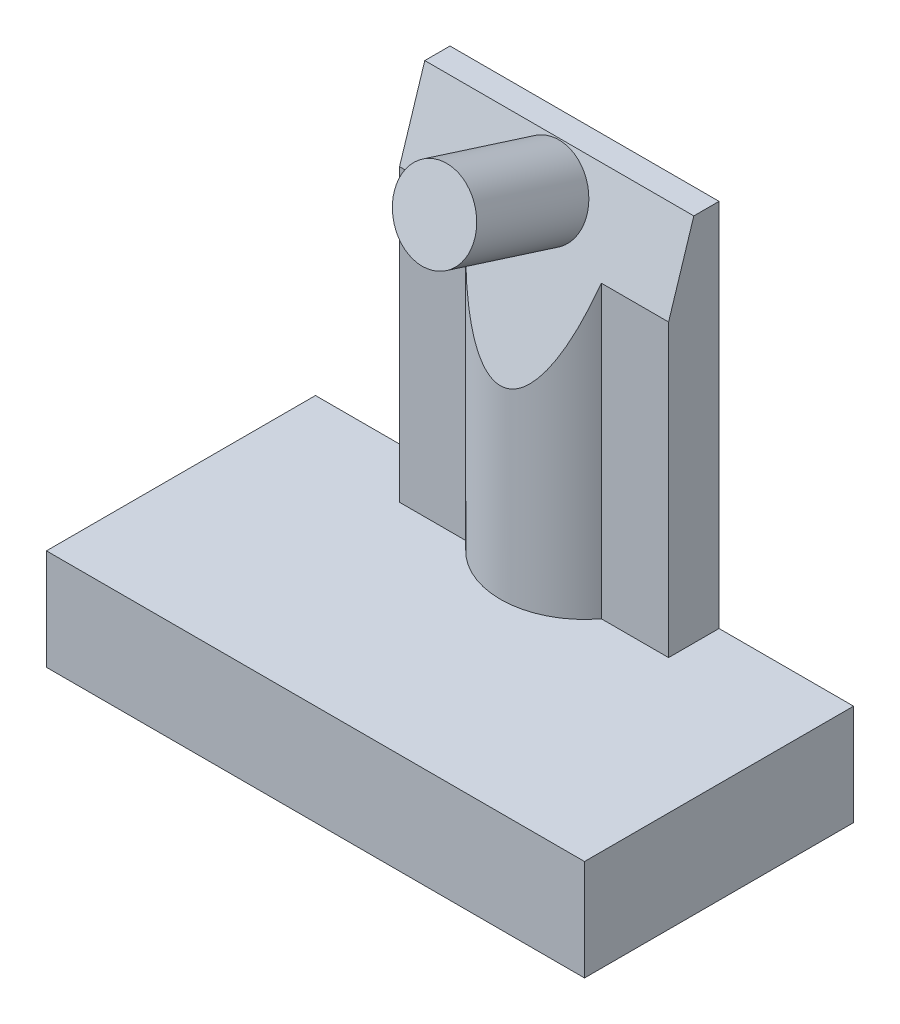
ISO-10303-21;
HEADER;
FILE_DESCRIPTION(('STEP AP214'),'2;1');
FILE_NAME('part.step','',(''),(''),'','','');
FILE_SCHEMA(('AUTOMOTIVE_DESIGN { 1 0 10303 214 1 1 1 1 }'));
ENDSEC;
DATA;
#1=APPLICATION_CONTEXT('core data for automotive mechanical design processes');
#2=APPLICATION_PROTOCOL_DEFINITION('international standard','automotive_design',2000,#1);
#3=PRODUCT_CONTEXT('',#1,'mechanical');
#4=PRODUCT('Part','Part','',(#3));
#5=PRODUCT_RELATED_PRODUCT_CATEGORY('part','',(#4));
#6=PRODUCT_DEFINITION_FORMATION('','',#4);
#7=PRODUCT_DEFINITION_CONTEXT('part definition',#1,'design');
#8=PRODUCT_DEFINITION('design','',#6,#7);
#9=PRODUCT_DEFINITION_SHAPE('','',#8);
#10=(LENGTH_UNIT() NAMED_UNIT(*) SI_UNIT(.MILLI.,.METRE.));
#11=(NAMED_UNIT(*) PLANE_ANGLE_UNIT() SI_UNIT($,.RADIAN.));
#12=(NAMED_UNIT(*) SI_UNIT($,.STERADIAN.) SOLID_ANGLE_UNIT());
#13=UNCERTAINTY_MEASURE_WITH_UNIT(LENGTH_MEASURE(1.E-05),#10,'distance_accuracy_value','');
#14=(GEOMETRIC_REPRESENTATION_CONTEXT(3) GLOBAL_UNCERTAINTY_ASSIGNED_CONTEXT((#13)) GLOBAL_UNIT_ASSIGNED_CONTEXT((#10,
#11,#12)) REPRESENTATION_CONTEXT('',''));
#15=CARTESIAN_POINT('',(0.,0.,0.));
#16=DIRECTION('',(0.,0.,1.));
#17=DIRECTION('',(1.,0.,0.));
#18=AXIS2_PLACEMENT_3D('',#15,#16,#17);
#19=CARTESIAN_POINT('',(8.,3.,-4.));
#20=DIRECTION('',(-1.,0.,0.));
#21=DIRECTION('',(0.,0.,1.));
#22=AXIS2_PLACEMENT_3D('',#19,#20,#21);
#23=PLANE('',#22);
#24=DIRECTION('',(0.,0.,-1.));
#25=VECTOR('',#24,1.);
#26=CARTESIAN_POINT('',(8.,0.,-4.));
#27=LINE('',#26,#25);
#28=CARTESIAN_POINT('',(8.,0.,4.));
#29=VERTEX_POINT('',#28);
#30=CARTESIAN_POINT('',(8.,0.,-4.));
#31=VERTEX_POINT('',#30);
#32=EDGE_CURVE('E208',#29,#31,#27,.T.);
#33=ORIENTED_EDGE('',*,*,#32,.T.);
#34=DIRECTION('',(0.,-1.,0.));
#35=VECTOR('',#34,1.);
#36=CARTESIAN_POINT('',(8.,3.,-4.));
#37=LINE('',#36,#35);
#38=CARTESIAN_POINT('',(8.,3.,-4.));
#39=VERTEX_POINT('',#38);
#40=EDGE_CURVE('E285',#39,#31,#37,.T.);
#41=ORIENTED_EDGE('',*,*,#40,.F.);
#42=DIRECTION('',(0.,0.,-1.));
#43=VECTOR('',#42,1.);
#44=CARTESIAN_POINT('',(8.,3.,-4.));
#45=LINE('',#44,#43);
#46=CARTESIAN_POINT('',(8.,3.,4.));
#47=VERTEX_POINT('',#46);
#48=EDGE_CURVE('E247',#47,#39,#45,.T.);
#49=ORIENTED_EDGE('',*,*,#48,.F.);
#50=DIRECTION('',(0.,-1.,0.));
#51=VECTOR('',#50,1.);
#52=CARTESIAN_POINT('',(8.,3.,4.));
#53=LINE('',#52,#51);
#54=EDGE_CURVE('E262',#47,#29,#53,.T.);
#55=ORIENTED_EDGE('',*,*,#54,.T.);
#56=EDGE_LOOP('',(#33,#41,#49,#55));
#57=FACE_BOUND('',#56,.T.);
#58=ADVANCED_FACE('F45',(#57),#23,.F.);
#59=CARTESIAN_POINT('',(-8.,3.,-4.));
#60=DIRECTION('',(0.,0.,1.));
#61=DIRECTION('',(1.,0.,0.));
#62=AXIS2_PLACEMENT_3D('',#59,#60,#61);
#63=PLANE('',#62);
#64=DIRECTION('',(-1.,0.,0.));
#65=VECTOR('',#64,1.);
#66=CARTESIAN_POINT('',(-8.,0.,-4.));
#67=LINE('',#66,#65);
#68=CARTESIAN_POINT('',(-8.,0.,-4.));
#69=VERTEX_POINT('',#68);
#70=EDGE_CURVE('E266',#31,#69,#67,.T.);
#71=ORIENTED_EDGE('',*,*,#70,.T.);
#72=DIRECTION('',(0.,-1.,0.));
#73=VECTOR('',#72,1.);
#74=CARTESIAN_POINT('',(-8.,3.,-4.));
#75=LINE('',#74,#73);
#76=CARTESIAN_POINT('',(-8.,3.,-4.));
#77=VERTEX_POINT('',#76);
#78=EDGE_CURVE('E281',#77,#69,#75,.T.);
#79=ORIENTED_EDGE('',*,*,#78,.F.);
#80=DIRECTION('',(-1.,0.,0.));
#81=VECTOR('',#80,1.);
#82=CARTESIAN_POINT('',(-8.,3.,-4.));
#83=LINE('',#82,#81);
#84=CARTESIAN_POINT('',(-4.,3.,-4.));
#85=VERTEX_POINT('',#84);
#86=EDGE_CURVE('E251',#85,#77,#83,.T.);
#87=ORIENTED_EDGE('',*,*,#86,.F.);
#88=DIRECTION('',(0.,-1.,0.));
#89=VECTOR('',#88,1.);
#90=CARTESIAN_POINT('',(-4.,14.,-4.));
#91=LINE('',#90,#89);
#92=CARTESIAN_POINT('',(-4.,14.,-4.));
#93=VERTEX_POINT('',#92);
#94=EDGE_CURVE('E188',#93,#85,#91,.T.);
#95=ORIENTED_EDGE('',*,*,#94,.F.);
#96=DIRECTION('',(-1.,0.,0.));
#97=VECTOR('',#96,1.);
#98=CARTESIAN_POINT('',(-4.,14.,-4.));
#99=LINE('',#98,#97);
#100=CARTESIAN_POINT('',(4.,14.,-4.));
#101=VERTEX_POINT('',#100);
#102=EDGE_CURVE('E308',#101,#93,#99,.T.);
#103=ORIENTED_EDGE('',*,*,#102,.F.);
#104=DIRECTION('',(0.,-1.,0.));
#105=VECTOR('',#104,1.);
#106=CARTESIAN_POINT('',(4.,14.,-4.));
#107=LINE('',#106,#105);
#108=CARTESIAN_POINT('',(4.,3.,-4.));
#109=VERTEX_POINT('',#108);
#110=EDGE_CURVE('E181',#101,#109,#107,.T.);
#111=ORIENTED_EDGE('',*,*,#110,.T.);
#112=EDGE_CURVE('E253',#39,#109,#83,.T.);
#113=ORIENTED_EDGE('',*,*,#112,.F.);
#114=ORIENTED_EDGE('',*,*,#40,.T.);
#115=EDGE_LOOP('',(#71,#79,#87,#95,#103,#111,#113,#114));
#116=FACE_BOUND('',#115,.T.);
#117=ADVANCED_FACE('F337',(#116),#63,.F.);
#118=CARTESIAN_POINT('',(-8.,3.,-4.));
#119=DIRECTION('',(1.,0.,0.));
#120=DIRECTION('',(0.,0.,-1.));
#121=AXIS2_PLACEMENT_3D('',#118,#119,#120);
#122=PLANE('',#121);
#123=DIRECTION('',(0.,0.,1.));
#124=VECTOR('',#123,1.);
#125=CARTESIAN_POINT('',(-8.,0.,-4.));
#126=LINE('',#125,#124);
#127=CARTESIAN_POINT('',(-8.,0.,4.));
#128=VERTEX_POINT('',#127);
#129=EDGE_CURVE('E269',#69,#128,#126,.T.);
#130=ORIENTED_EDGE('',*,*,#129,.T.);
#131=DIRECTION('',(0.,-1.,0.));
#132=VECTOR('',#131,1.);
#133=CARTESIAN_POINT('',(-8.,3.,4.));
#134=LINE('',#133,#132);
#135=CARTESIAN_POINT('',(-8.,3.,4.));
#136=VERTEX_POINT('',#135);
#137=EDGE_CURVE('E277',#136,#128,#134,.T.);
#138=ORIENTED_EDGE('',*,*,#137,.F.);
#139=DIRECTION('',(0.,0.,1.));
#140=VECTOR('',#139,1.);
#141=CARTESIAN_POINT('',(-8.,3.,-4.));
#142=LINE('',#141,#140);
#143=EDGE_CURVE('E256',#77,#136,#142,.T.);
#144=ORIENTED_EDGE('',*,*,#143,.F.);
#145=ORIENTED_EDGE('',*,*,#78,.T.);
#146=EDGE_LOOP('',(#130,#138,#144,#145));
#147=FACE_BOUND('',#146,.T.);
#148=ADVANCED_FACE('F365',(#147),#122,.F.);
#149=CARTESIAN_POINT('',(-8.,3.,4.));
#150=DIRECTION('',(0.,0.,-1.));
#151=DIRECTION('',(-1.,0.,0.));
#152=AXIS2_PLACEMENT_3D('',#149,#150,#151);
#153=PLANE('',#152);
#154=DIRECTION('',(1.,0.,0.));
#155=VECTOR('',#154,1.);
#156=CARTESIAN_POINT('',(-8.,0.,4.));
#157=LINE('',#156,#155);
#158=EDGE_CURVE('E252',#128,#29,#157,.T.);
#159=ORIENTED_EDGE('',*,*,#158,.T.);
#160=ORIENTED_EDGE('',*,*,#54,.F.);
#161=DIRECTION('',(1.,0.,0.));
#162=VECTOR('',#161,1.);
#163=CARTESIAN_POINT('',(-8.,3.,4.));
#164=LINE('',#163,#162);
#165=EDGE_CURVE('E259',#136,#47,#164,.T.);
#166=ORIENTED_EDGE('',*,*,#165,.F.);
#167=ORIENTED_EDGE('',*,*,#137,.T.);
#168=EDGE_LOOP('',(#159,#160,#166,#167));
#169=FACE_BOUND('',#168,.T.);
#170=ADVANCED_FACE('F367',(#169),#153,.F.);
#171=CARTESIAN_POINT('',(0.,3.,0.));
#172=DIRECTION('',(0.,1.,0.));
#173=DIRECTION('',(0.,0.,1.));
#174=AXIS2_PLACEMENT_3D('',#171,#172,#173);
#175=PLANE('',#174);
#176=DIRECTION('',(0.,0.,1.));
#177=VECTOR('',#176,1.);
#178=CARTESIAN_POINT('',(-4.,3.,-4.));
#179=LINE('',#178,#177);
#180=CARTESIAN_POINT('',(-4.,3.,-2.5));
#181=VERTEX_POINT('',#180);
#182=EDGE_CURVE('E327',#85,#181,#179,.T.);
#183=ORIENTED_EDGE('',*,*,#182,.F.);
#184=ORIENTED_EDGE('',*,*,#86,.T.);
#185=ORIENTED_EDGE('',*,*,#143,.T.);
#186=ORIENTED_EDGE('',*,*,#165,.T.);
#187=ORIENTED_EDGE('',*,*,#48,.T.);
#188=ORIENTED_EDGE('',*,*,#112,.T.);
#189=DIRECTION('',(0.,0.,-1.));
#190=VECTOR('',#189,1.);
#191=CARTESIAN_POINT('',(4.,3.,-4.));
#192=LINE('',#191,#190);
#193=CARTESIAN_POINT('',(4.,3.,-2.5));
#194=VERTEX_POINT('',#193);
#195=EDGE_CURVE('E324',#194,#109,#192,.T.);
#196=ORIENTED_EDGE('',*,*,#195,.F.);
#197=DIRECTION('',(1.,0.,0.));
#198=VECTOR('',#197,1.);
#199=CARTESIAN_POINT('',(4.,3.,-2.5));
#200=LINE('',#199,#198);
#201=CARTESIAN_POINT('',(2.,3.,-2.5));
#202=VERTEX_POINT('',#201);
#203=EDGE_CURVE('E178',#202,#194,#200,.T.);
#204=ORIENTED_EDGE('',*,*,#203,.F.);
#205=CARTESIAN_POINT('',(0.,3.,-4.));
#206=DIRECTION('',(0.,1.,0.));
#207=DIRECTION('',(0.,0.,1.));
#208=AXIS2_PLACEMENT_3D('',#205,#206,#207);
#209=CIRCLE('',#208,2.5);
#210=CARTESIAN_POINT('',(-2.,3.,-2.5));
#211=VERTEX_POINT('',#210);
#212=EDGE_CURVE('E161',#211,#202,#209,.T.);
#213=ORIENTED_EDGE('',*,*,#212,.F.);
#214=DIRECTION('',(1.,0.,0.));
#215=VECTOR('',#214,1.);
#216=CARTESIAN_POINT('',(-4.,3.,-2.5));
#217=LINE('',#216,#215);
#218=EDGE_CURVE('E330',#181,#211,#217,.T.);
#219=ORIENTED_EDGE('',*,*,#218,.F.);
#220=EDGE_LOOP('',(#183,#184,#185,#186,#187,#188,#196,#204,#213,#219));
#221=FACE_BOUND('',#220,.T.);
#222=ADVANCED_FACE('F342',(#221),#175,.T.);
#223=CARTESIAN_POINT('',(0.,0.,0.));
#224=DIRECTION('',(0.,1.,0.));
#225=DIRECTION('',(0.,0.,1.));
#226=AXIS2_PLACEMENT_3D('',#223,#224,#225);
#227=PLANE('',#226);
#228=DIRECTION('',(1.,0.,0.));
#229=VECTOR('',#228,1.);
#230=CARTESIAN_POINT('',(-8.,0.,3.));
#231=LINE('',#230,#229);
#232=CARTESIAN_POINT('',(-7.,0.,3.));
#233=VERTEX_POINT('',#232);
#234=CARTESIAN_POINT('',(7.,0.,3.));
#235=VERTEX_POINT('',#234);
#236=EDGE_CURVE('E215',#233,#235,#231,.T.);
#237=ORIENTED_EDGE('',*,*,#236,.T.);
#238=DIRECTION('',(0.,0.,-1.));
#239=VECTOR('',#238,1.);
#240=CARTESIAN_POINT('',(7.,0.,-4.));
#241=LINE('',#240,#239);
#242=CARTESIAN_POINT('',(7.,0.,-3.));
#243=VERTEX_POINT('',#242);
#244=EDGE_CURVE('E203',#235,#243,#241,.T.);
#245=ORIENTED_EDGE('',*,*,#244,.T.);
#246=DIRECTION('',(-1.,0.,0.));
#247=VECTOR('',#246,1.);
#248=CARTESIAN_POINT('',(-8.,0.,-3.));
#249=LINE('',#248,#247);
#250=CARTESIAN_POINT('',(-7.,0.,-3.));
#251=VERTEX_POINT('',#250);
#252=EDGE_CURVE('E236',#243,#251,#249,.T.);
#253=ORIENTED_EDGE('',*,*,#252,.T.);
#254=DIRECTION('',(0.,0.,1.));
#255=VECTOR('',#254,1.);
#256=CARTESIAN_POINT('',(-7.,0.,-4.));
#257=LINE('',#256,#255);
#258=EDGE_CURVE('E240',#251,#233,#257,.T.);
#259=ORIENTED_EDGE('',*,*,#258,.T.);
#260=EDGE_LOOP('',(#237,#245,#253,#259));
#261=FACE_BOUND('',#260,.T.);
#262=ORIENTED_EDGE('',*,*,#32,.F.);
#263=ORIENTED_EDGE('',*,*,#158,.F.);
#264=ORIENTED_EDGE('',*,*,#129,.F.);
#265=ORIENTED_EDGE('',*,*,#70,.F.);
#266=EDGE_LOOP('',(#262,#263,#264,#265));
#267=FACE_BOUND('',#266,.T.);
#268=ADVANCED_FACE('F362',(#261,#267),#227,.F.);
#269=CARTESIAN_POINT('',(7.,3.,-4.));
#270=DIRECTION('',(-1.,0.,0.));
#271=DIRECTION('',(0.,0.,1.));
#272=AXIS2_PLACEMENT_3D('',#269,#270,#271);
#273=PLANE('',#272);
#274=ORIENTED_EDGE('',*,*,#244,.F.);
#275=DIRECTION('',(0.,-1.,0.));
#276=VECTOR('',#275,1.);
#277=CARTESIAN_POINT('',(7.,3.,3.));
#278=LINE('',#277,#276);
#279=CARTESIAN_POINT('',(7.,2.,3.));
#280=VERTEX_POINT('',#279);
#281=EDGE_CURVE('E216',#280,#235,#278,.T.);
#282=ORIENTED_EDGE('',*,*,#281,.F.);
#283=DIRECTION('',(0.,0.,-1.));
#284=VECTOR('',#283,1.);
#285=CARTESIAN_POINT('',(7.,2.,-4.));
#286=LINE('',#285,#284);
#287=CARTESIAN_POINT('',(7.,2.,-3.));
#288=VERTEX_POINT('',#287);
#289=EDGE_CURVE('E210',#280,#288,#286,.T.);
#290=ORIENTED_EDGE('',*,*,#289,.T.);
#291=DIRECTION('',(0.,-1.,0.));
#292=VECTOR('',#291,1.);
#293=CARTESIAN_POINT('',(7.,3.,-3.));
#294=LINE('',#293,#292);
#295=EDGE_CURVE('E204',#288,#243,#294,.T.);
#296=ORIENTED_EDGE('',*,*,#295,.T.);
#297=EDGE_LOOP('',(#274,#282,#290,#296));
#298=FACE_BOUND('',#297,.T.);
#299=ADVANCED_FACE('F408',(#298),#273,.T.);
#300=CARTESIAN_POINT('',(-8.,3.,-3.));
#301=DIRECTION('',(0.,0.,1.));
#302=DIRECTION('',(1.,0.,0.));
#303=AXIS2_PLACEMENT_3D('',#300,#301,#302);
#304=PLANE('',#303);
#305=ORIENTED_EDGE('',*,*,#252,.F.);
#306=ORIENTED_EDGE('',*,*,#295,.F.);
#307=DIRECTION('',(-1.,0.,0.));
#308=VECTOR('',#307,1.);
#309=CARTESIAN_POINT('',(-8.,2.,-3.));
#310=LINE('',#309,#308);
#311=CARTESIAN_POINT('',(-7.,2.,-3.));
#312=VERTEX_POINT('',#311);
#313=EDGE_CURVE('E214',#288,#312,#310,.T.);
#314=ORIENTED_EDGE('',*,*,#313,.T.);
#315=DIRECTION('',(0.,-1.,0.));
#316=VECTOR('',#315,1.);
#317=CARTESIAN_POINT('',(-7.,3.,-3.));
#318=LINE('',#317,#316);
#319=EDGE_CURVE('E209',#312,#251,#318,.T.);
#320=ORIENTED_EDGE('',*,*,#319,.T.);
#321=EDGE_LOOP('',(#305,#306,#314,#320));
#322=FACE_BOUND('',#321,.T.);
#323=ADVANCED_FACE('F418',(#322),#304,.T.);
#324=CARTESIAN_POINT('',(-7.,3.,-4.));
#325=DIRECTION('',(1.,0.,0.));
#326=DIRECTION('',(0.,0.,-1.));
#327=AXIS2_PLACEMENT_3D('',#324,#325,#326);
#328=PLANE('',#327);
#329=ORIENTED_EDGE('',*,*,#258,.F.);
#330=ORIENTED_EDGE('',*,*,#319,.F.);
#331=DIRECTION('',(0.,0.,1.));
#332=VECTOR('',#331,1.);
#333=CARTESIAN_POINT('',(-7.,2.,-4.));
#334=LINE('',#333,#332);
#335=CARTESIAN_POINT('',(-7.,2.,3.));
#336=VERTEX_POINT('',#335);
#337=EDGE_CURVE('E226',#312,#336,#334,.T.);
#338=ORIENTED_EDGE('',*,*,#337,.T.);
#339=DIRECTION('',(0.,-1.,0.));
#340=VECTOR('',#339,1.);
#341=CARTESIAN_POINT('',(-7.,3.,3.));
#342=LINE('',#341,#340);
#343=EDGE_CURVE('E219',#336,#233,#342,.T.);
#344=ORIENTED_EDGE('',*,*,#343,.T.);
#345=EDGE_LOOP('',(#329,#330,#338,#344));
#346=FACE_BOUND('',#345,.T.);
#347=ADVANCED_FACE('F429',(#346),#328,.T.);
#348=CARTESIAN_POINT('',(-8.,3.,3.));
#349=DIRECTION('',(0.,0.,-1.));
#350=DIRECTION('',(-1.,0.,0.));
#351=AXIS2_PLACEMENT_3D('',#348,#349,#350);
#352=PLANE('',#351);
#353=ORIENTED_EDGE('',*,*,#236,.F.);
#354=ORIENTED_EDGE('',*,*,#343,.F.);
#355=DIRECTION('',(1.,0.,0.));
#356=VECTOR('',#355,1.);
#357=CARTESIAN_POINT('',(-8.,2.,3.));
#358=LINE('',#357,#356);
#359=EDGE_CURVE('E220',#336,#280,#358,.T.);
#360=ORIENTED_EDGE('',*,*,#359,.T.);
#361=ORIENTED_EDGE('',*,*,#281,.T.);
#362=EDGE_LOOP('',(#353,#354,#360,#361));
#363=FACE_BOUND('',#362,.T.);
#364=ADVANCED_FACE('F440',(#363),#352,.T.);
#365=CARTESIAN_POINT('',(0.,2.,0.));
#366=DIRECTION('',(0.,1.,0.));
#367=DIRECTION('',(0.,0.,1.));
#368=AXIS2_PLACEMENT_3D('',#365,#366,#367);
#369=PLANE('',#368);
#370=CARTESIAN_POINT('',(0.,2.,0.));
#371=DIRECTION('',(0.,1.,0.));
#372=DIRECTION('',(0.,0.,1.));
#373=AXIS2_PLACEMENT_3D('',#370,#371,#372);
#374=CIRCLE('',#373,1.5);
#375=CARTESIAN_POINT('',(0.,2.,1.5));
#376=VERTEX_POINT('',#375);
#377=EDGE_CURVE('E288',#376,#376,#374,.F.);
#378=ORIENTED_EDGE('',*,*,#377,.F.);
#379=EDGE_LOOP('',(#378));
#380=FACE_BOUND('',#379,.T.);
#381=ORIENTED_EDGE('',*,*,#289,.F.);
#382=ORIENTED_EDGE('',*,*,#359,.F.);
#383=ORIENTED_EDGE('',*,*,#337,.F.);
#384=ORIENTED_EDGE('',*,*,#313,.F.);
#385=EDGE_LOOP('',(#381,#382,#383,#384));
#386=FACE_BOUND('',#385,.T.);
#387=ADVANCED_FACE('F451',(#380,#386),#369,.F.);
#388=CARTESIAN_POINT('',(0.,0.,0.));
#389=DIRECTION('',(0.,-1.,0.));
#390=DIRECTION('',(0.,0.,-1.));
#391=AXIS2_PLACEMENT_3D('',#388,#389,#390);
#392=PLANE('',#391);
#393=CARTESIAN_POINT('',(0.,0.,0.));
#394=DIRECTION('',(0.,-1.,0.));
#395=DIRECTION('',(0.,0.,-1.));
#396=AXIS2_PLACEMENT_3D('',#393,#394,#395);
#397=CIRCLE('',#396,1.5);
#398=CARTESIAN_POINT('',(0.,0.,-1.5));
#399=VERTEX_POINT('',#398);
#400=EDGE_CURVE('E196',#399,#399,#397,.T.);
#401=ORIENTED_EDGE('',*,*,#400,.T.);
#402=EDGE_LOOP('',(#401));
#403=FACE_BOUND('',#402,.T.);
#404=CARTESIAN_POINT('',(0.,0.,0.));
#405=DIRECTION('',(0.,-1.,0.));
#406=DIRECTION('',(0.,0.,-1.));
#407=AXIS2_PLACEMENT_3D('',#404,#405,#406);
#408=CIRCLE('',#407,0.8);
#409=CARTESIAN_POINT('',(0.,0.,-0.8));
#410=VERTEX_POINT('',#409);
#411=EDGE_CURVE('E192',#410,#410,#408,.T.);
#412=ORIENTED_EDGE('',*,*,#411,.F.);
#413=EDGE_LOOP('',(#412));
#414=FACE_BOUND('',#413,.T.);
#415=ADVANCED_FACE('F462',(#403,#414),#392,.T.);
#416=CARTESIAN_POINT('',(0.,0.,0.));
#417=DIRECTION('',(0.,1.,0.));
#418=DIRECTION('',(0.,0.,1.));
#419=AXIS2_PLACEMENT_3D('',#416,#417,#418);
#420=CYLINDRICAL_SURFACE('',#419,1.5);
#421=ORIENTED_EDGE('',*,*,#400,.F.);
#422=EDGE_LOOP('',(#421));
#423=FACE_BOUND('',#422,.T.);
#424=ORIENTED_EDGE('',*,*,#377,.T.);
#425=EDGE_LOOP('',(#424));
#426=FACE_BOUND('',#425,.T.);
#427=ADVANCED_FACE('F475',(#423,#426),#420,.T.);
#428=CARTESIAN_POINT('',(0.,0.,0.));
#429=DIRECTION('',(0.,1.,0.));
#430=DIRECTION('',(0.,0.,1.));
#431=AXIS2_PLACEMENT_3D('',#428,#429,#430);
#432=CYLINDRICAL_SURFACE('',#431,0.8);
#433=ORIENTED_EDGE('',*,*,#411,.T.);
#434=EDGE_LOOP('',(#433));
#435=FACE_BOUND('',#434,.T.);
#436=CARTESIAN_POINT('',(0.,2.,0.));
#437=DIRECTION('',(0.,-1.,0.));
#438=DIRECTION('',(0.,0.,-1.));
#439=AXIS2_PLACEMENT_3D('',#436,#437,#438);
#440=CIRCLE('',#439,0.8);
#441=CARTESIAN_POINT('',(0.,2.,-0.8));
#442=VERTEX_POINT('',#441);
#443=EDGE_CURVE('E185',#442,#442,#440,.T.);
#444=ORIENTED_EDGE('',*,*,#443,.F.);
#445=EDGE_LOOP('',(#444));
#446=FACE_BOUND('',#445,.T.);
#447=ADVANCED_FACE('F486',(#435,#446),#432,.F.);
#448=ORIENTED_EDGE('',*,*,#443,.T.);
#449=EDGE_LOOP('',(#448));
#450=FACE_BOUND('',#449,.T.);
#451=ADVANCED_FACE('F465',(#450),#369,.F.);
#452=CARTESIAN_POINT('',(0.,14.,-4.));
#453=DIRECTION('',(0.,-1.,0.));
#454=DIRECTION('',(0.,0.,-1.));
#455=AXIS2_PLACEMENT_3D('',#452,#453,#454);
#456=CYLINDRICAL_SURFACE('',#455,2.5);
#457=CARTESIAN_POINT('',(0.,16.3571428571428,-4.));
#458=DIRECTION('',(0.,-0.303203657276948,-0.952925780013262));
#459=DIRECTION('',(0.,-0.952925780013262,0.303203657276948));
#460=AXIS2_PLACEMENT_3D('',#457,#458,#459);
#461=ELLIPSE('',#460,8.24528312901084,2.5);
#462=CARTESIAN_POINT('',(2.,11.6428571428571,-2.5));
#463=VERTEX_POINT('',#462);
#464=CARTESIAN_POINT('',(-2.,11.6428571428571,-2.5));
#465=VERTEX_POINT('',#464);
#466=EDGE_CURVE('E156',#463,#465,#461,.T.);
#467=ORIENTED_EDGE('',*,*,#466,.T.);
#468=DIRECTION('',(0.,-1.,0.));
#469=VECTOR('',#468,1.);
#470=CARTESIAN_POINT('',(-2.,14.,-2.5));
#471=LINE('',#470,#469);
#472=EDGE_CURVE('E311',#465,#211,#471,.T.);
#473=ORIENTED_EDGE('',*,*,#472,.T.);
#474=ORIENTED_EDGE('',*,*,#212,.T.);
#475=DIRECTION('',(0.,-1.,0.));
#476=VECTOR('',#475,1.);
#477=CARTESIAN_POINT('',(2.,14.,-2.5));
#478=LINE('',#477,#476);
#479=EDGE_CURVE('E180',#463,#202,#478,.T.);
#480=ORIENTED_EDGE('',*,*,#479,.F.);
#481=EDGE_LOOP('',(#467,#473,#474,#480));
#482=FACE_BOUND('',#481,.T.);
#483=ADVANCED_FACE('F348',(#482),#456,.T.);
#484=CARTESIAN_POINT('',(4.,14.,-2.5));
#485=DIRECTION('',(0.,0.,-1.));
#486=DIRECTION('',(-1.,0.,0.));
#487=AXIS2_PLACEMENT_3D('',#484,#485,#486);
#488=PLANE('',#487);
#489=DIRECTION('',(0.,-1.,0.));
#490=VECTOR('',#489,1.);
#491=CARTESIAN_POINT('',(4.,14.,-2.5));
#492=LINE('',#491,#490);
#493=CARTESIAN_POINT('',(4.,11.6428571428571,-2.5));
#494=VERTEX_POINT('',#493);
#495=EDGE_CURVE('E167',#494,#194,#492,.T.);
#496=ORIENTED_EDGE('',*,*,#495,.F.);
#497=DIRECTION('',(-1.,0.,0.));
#498=VECTOR('',#497,1.);
#499=CARTESIAN_POINT('',(4.,11.6428571428571,-2.5));
#500=LINE('',#499,#498);
#501=EDGE_CURVE('E153',#494,#463,#500,.T.);
#502=ORIENTED_EDGE('',*,*,#501,.T.);
#503=ORIENTED_EDGE('',*,*,#479,.T.);
#504=ORIENTED_EDGE('',*,*,#203,.T.);
#505=EDGE_LOOP('',(#496,#502,#503,#504));
#506=FACE_BOUND('',#505,.T.);
#507=ADVANCED_FACE('F176',(#506),#488,.F.);
#508=CARTESIAN_POINT('',(4.,14.,-4.));
#509=DIRECTION('',(-1.,0.,0.));
#510=DIRECTION('',(0.,0.,1.));
#511=AXIS2_PLACEMENT_3D('',#508,#509,#510);
#512=PLANE('',#511);
#513=DIRECTION('',(0.,0.,-1.));
#514=VECTOR('',#513,1.);
#515=CARTESIAN_POINT('',(4.,14.,-4.));
#516=LINE('',#515,#514);
#517=CARTESIAN_POINT('',(4.,14.,-3.25));
#518=VERTEX_POINT('',#517);
#519=EDGE_CURVE('E170',#518,#101,#516,.T.);
#520=ORIENTED_EDGE('',*,*,#519,.F.);
#521=DIRECTION('',(0.,0.952925780013262,-0.303203657276948));
#522=VECTOR('',#521,1.);
#523=CARTESIAN_POINT('',(4.,8.5,-1.5));
#524=LINE('',#523,#522);
#525=EDGE_CURVE('E61',#494,#518,#524,.T.);
#526=ORIENTED_EDGE('',*,*,#525,.F.);
#527=ORIENTED_EDGE('',*,*,#495,.T.);
#528=ORIENTED_EDGE('',*,*,#195,.T.);
#529=ORIENTED_EDGE('',*,*,#110,.F.);
#530=EDGE_LOOP('',(#520,#526,#527,#528,#529));
#531=FACE_BOUND('',#530,.T.);
#532=ADVANCED_FACE('F165',(#531),#512,.F.);
#533=CARTESIAN_POINT('',(-4.,14.,-4.));
#534=DIRECTION('',(1.,0.,0.));
#535=DIRECTION('',(0.,0.,-1.));
#536=AXIS2_PLACEMENT_3D('',#533,#534,#535);
#537=PLANE('',#536);
#538=DIRECTION('',(0.,-1.,0.));
#539=VECTOR('',#538,1.);
#540=CARTESIAN_POINT('',(-4.,14.,-2.5));
#541=LINE('',#540,#539);
#542=CARTESIAN_POINT('',(-4.,11.6428571428571,-2.5));
#543=VERTEX_POINT('',#542);
#544=EDGE_CURVE('E69',#543,#181,#541,.T.);
#545=ORIENTED_EDGE('',*,*,#544,.F.);
#546=DIRECTION('',(0.,0.952925780013262,-0.303203657276948));
#547=VECTOR('',#546,1.);
#548=CARTESIAN_POINT('',(-4.,14.2166979362101,-3.31894934333959));
#549=LINE('',#548,#547);
#550=CARTESIAN_POINT('',(-4.00000000000001,14.,-3.25));
#551=VERTEX_POINT('',#550);
#552=EDGE_CURVE('E295',#543,#551,#549,.T.);
#553=ORIENTED_EDGE('',*,*,#552,.T.);
#554=DIRECTION('',(0.,0.,1.));
#555=VECTOR('',#554,1.);
#556=CARTESIAN_POINT('',(-4.,14.,-4.));
#557=LINE('',#556,#555);
#558=EDGE_CURVE('E302',#93,#551,#557,.T.);
#559=ORIENTED_EDGE('',*,*,#558,.F.);
#560=ORIENTED_EDGE('',*,*,#94,.T.);
#561=ORIENTED_EDGE('',*,*,#182,.T.);
#562=EDGE_LOOP('',(#545,#553,#559,#560,#561));
#563=FACE_BOUND('',#562,.T.);
#564=ADVANCED_FACE('F300',(#563),#537,.F.);
#565=CARTESIAN_POINT('',(-4.,14.,-2.5));
#566=DIRECTION('',(0.,0.,-1.));
#567=DIRECTION('',(-1.,0.,0.));
#568=AXIS2_PLACEMENT_3D('',#565,#566,#567);
#569=PLANE('',#568);
#570=ORIENTED_EDGE('',*,*,#472,.F.);
#571=DIRECTION('',(-1.,0.,0.));
#572=VECTOR('',#571,1.);
#573=CARTESIAN_POINT('',(-4.,11.6428571428571,-2.5));
#574=LINE('',#573,#572);
#575=EDGE_CURVE('E172',#465,#543,#574,.T.);
#576=ORIENTED_EDGE('',*,*,#575,.T.);
#577=ORIENTED_EDGE('',*,*,#544,.T.);
#578=ORIENTED_EDGE('',*,*,#218,.T.);
#579=EDGE_LOOP('',(#570,#576,#577,#578));
#580=FACE_BOUND('',#579,.T.);
#581=ADVANCED_FACE('F346',(#580),#569,.F.);
#582=CARTESIAN_POINT('',(0.,14.,-4.));
#583=DIRECTION('',(0.,1.,0.));
#584=DIRECTION('',(0.,0.,1.));
#585=AXIS2_PLACEMENT_3D('',#582,#583,#584);
#586=PLANE('',#585);
#587=DIRECTION('',(-1.,0.,0.));
#588=VECTOR('',#587,1.);
#589=CARTESIAN_POINT('',(0.,14.,-3.25));
#590=LINE('',#589,#588);
#591=EDGE_CURVE('E48',#518,#551,#590,.T.);
#592=ORIENTED_EDGE('',*,*,#591,.F.);
#593=ORIENTED_EDGE('',*,*,#519,.T.);
#594=ORIENTED_EDGE('',*,*,#102,.T.);
#595=ORIENTED_EDGE('',*,*,#558,.T.);
#596=EDGE_LOOP('',(#592,#593,#594,#595));
#597=FACE_BOUND('',#596,.T.);
#598=ADVANCED_FACE('F306',(#597),#586,.T.);
#599=CARTESIAN_POINT('',(-8.,8.5,-1.5));
#600=DIRECTION('',(0.,-0.303203657276948,-0.952925780013262));
#601=DIRECTION('',(0.,0.952925780013262,-0.303203657276948));
#602=AXIS2_PLACEMENT_3D('',#599,#600,#601);
#603=PLANE('',#602);
#604=CARTESIAN_POINT('',(0.,12.8214285714286,-2.875));
#605=DIRECTION('',(0.,0.303203657276948,0.952925780013262));
#606=DIRECTION('',(0.,-0.952925780013262,0.303203657276948));
#607=AXIS2_PLACEMENT_3D('',#604,#605,#606);
#608=CIRCLE('',#607,1.2);
#609=CARTESIAN_POINT('',(0.,11.6779176354127,-2.51115561126767));
#610=VERTEX_POINT('',#609);
#611=EDGE_CURVE('E11',#610,#610,#608,.T.);
#612=ORIENTED_EDGE('',*,*,#611,.F.);
#613=EDGE_LOOP('',(#612));
#614=FACE_BOUND('',#613,.T.);
#615=ORIENTED_EDGE('',*,*,#525,.T.);
#616=ORIENTED_EDGE('',*,*,#591,.T.);
#617=ORIENTED_EDGE('',*,*,#552,.F.);
#618=ORIENTED_EDGE('',*,*,#575,.F.);
#619=ORIENTED_EDGE('',*,*,#466,.F.);
#620=ORIENTED_EDGE('',*,*,#501,.F.);
#621=EDGE_LOOP('',(#615,#616,#617,#618,#619,#620));
#622=FACE_BOUND('',#621,.T.);
#623=ADVANCED_FACE('F154',(#614,#622),#603,.F.);
#624=CARTESIAN_POINT('',(0.,13.8826413718979,0.460240230046414));
#625=DIRECTION('',(0.,-0.303203657276948,-0.952925780013262));
#626=DIRECTION('',(0.,0.952925780013262,-0.303203657276948));
#627=AXIS2_PLACEMENT_3D('',#624,#625,#626);
#628=CYLINDRICAL_SURFACE('',#627,1.2);
#629=CARTESIAN_POINT('',(0.,13.8826413718979,0.460240230046414));
#630=DIRECTION('',(0.,0.303203657276948,0.952925780013262));
#631=DIRECTION('',(0.,-0.952925780013262,0.303203657276948));
#632=AXIS2_PLACEMENT_3D('',#629,#630,#631);
#633=CIRCLE('',#632,1.2);
#634=CARTESIAN_POINT('',(0.,12.739130435882,0.824084618778751));
#635=VERTEX_POINT('',#634);
#636=EDGE_CURVE('E173',#635,#635,#633,.T.);
#637=ORIENTED_EDGE('',*,*,#636,.F.);
#638=EDGE_LOOP('',(#637));
#639=FACE_BOUND('',#638,.T.);
#640=ORIENTED_EDGE('',*,*,#611,.T.);
#641=EDGE_LOOP('',(#640));
#642=FACE_BOUND('',#641,.T.);
#643=ADVANCED_FACE('F548',(#639,#642),#628,.T.);
#644=CARTESIAN_POINT('',(0.,13.8826413718979,0.460240230046414));
#645=DIRECTION('',(0.,0.303203657276948,0.952925780013262));
#646=DIRECTION('',(0.,-0.952925780013262,0.303203657276948));
#647=AXIS2_PLACEMENT_3D('',#644,#645,#646);
#648=PLANE('',#647);
#649=ORIENTED_EDGE('',*,*,#636,.T.);
#650=EDGE_LOOP('',(#649));
#651=FACE_BOUND('',#650,.T.);
#652=ADVANCED_FACE('F556',(#651),#648,.T.);
#653=CLOSED_SHELL('',(#58,#117,#148,#170,#222,#268,#299,#323,#347,#364,#387,#415,#427,#447,#451,
#483,#507,#532,#564,#581,#598,#623,#643,#652));
#654=MANIFOLD_SOLID_BREP('B2',#653);
#655=ADVANCED_BREP_SHAPE_REPRESENTATION('',(#18,#654),#14);
#656=SHAPE_DEFINITION_REPRESENTATION(#9,#655);
ENDSEC;
END-ISO-10303-21;
